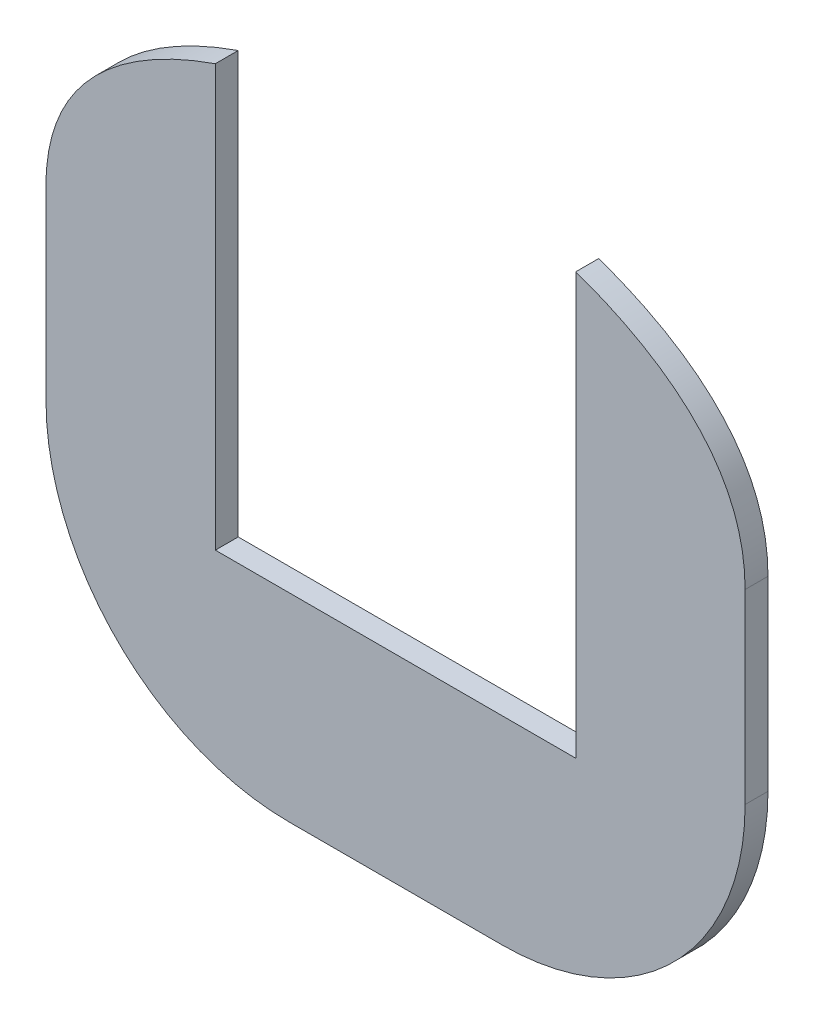
ISO-10303-21;
HEADER;
FILE_DESCRIPTION(('STEP AP214'),'2;1');
FILE_NAME('part.step','',(''),(''),'','','');
FILE_SCHEMA(('AUTOMOTIVE_DESIGN { 1 0 10303 214 1 1 1 1 }'));
ENDSEC;
DATA;
#1=APPLICATION_CONTEXT('core data for automotive mechanical design processes');
#2=APPLICATION_PROTOCOL_DEFINITION('international standard','automotive_design',2000,#1);
#3=PRODUCT_CONTEXT('',#1,'mechanical');
#4=PRODUCT('Part','Part','',(#3));
#5=PRODUCT_RELATED_PRODUCT_CATEGORY('part','',(#4));
#6=PRODUCT_DEFINITION_FORMATION('','',#4);
#7=PRODUCT_DEFINITION_CONTEXT('part definition',#1,'design');
#8=PRODUCT_DEFINITION('design','',#6,#7);
#9=PRODUCT_DEFINITION_SHAPE('','',#8);
#10=(LENGTH_UNIT() NAMED_UNIT(*) SI_UNIT(.MILLI.,.METRE.));
#11=(NAMED_UNIT(*) PLANE_ANGLE_UNIT() SI_UNIT($,.RADIAN.));
#12=(NAMED_UNIT(*) SI_UNIT($,.STERADIAN.) SOLID_ANGLE_UNIT());
#13=UNCERTAINTY_MEASURE_WITH_UNIT(LENGTH_MEASURE(1.E-05),#10,'distance_accuracy_value','');
#14=(GEOMETRIC_REPRESENTATION_CONTEXT(3) GLOBAL_UNCERTAINTY_ASSIGNED_CONTEXT((#13)) GLOBAL_UNIT_ASSIGNED_CONTEXT((#10,
#11,#12)) REPRESENTATION_CONTEXT('',''));
#15=CARTESIAN_POINT('',(0.,0.,0.));
#16=DIRECTION('',(0.,0.,1.));
#17=DIRECTION('',(1.,0.,0.));
#18=AXIS2_PLACEMENT_3D('',#15,#16,#17);
#19=CARTESIAN_POINT('',(-20.,-46.5,4.3));
#20=DIRECTION('',(0.,0.,-1.));
#21=DIRECTION('',(-1.,0.,0.));
#22=AXIS2_PLACEMENT_3D('',#19,#20,#21);
#23=CYLINDRICAL_SURFACE('',#22,45.7);
#24=CARTESIAN_POINT('',(-20.,-46.5,0.));
#25=DIRECTION('',(0.,0.,1.));
#26=DIRECTION('',(1.,0.,0.));
#27=AXIS2_PLACEMENT_3D('',#24,#25,#26);
#28=CIRCLE('',#27,45.7);
#29=CARTESIAN_POINT('',(-65.7,-46.5,0.));
#30=VERTEX_POINT('',#29);
#31=CARTESIAN_POINT('',(-20.,-92.2,0.));
#32=VERTEX_POINT('',#31);
#33=EDGE_CURVE('E178',#30,#32,#28,.T.);
#34=ORIENTED_EDGE('',*,*,#33,.T.);
#35=DIRECTION('',(0.,0.,-1.));
#36=VECTOR('',#35,1.);
#37=CARTESIAN_POINT('',(-20.,-92.2,4.3));
#38=LINE('',#37,#36);
#39=CARTESIAN_POINT('',(-20.,-92.2,4.3));
#40=VERTEX_POINT('',#39);
#41=EDGE_CURVE('E172',#40,#32,#38,.T.);
#42=ORIENTED_EDGE('',*,*,#41,.F.);
#43=CARTESIAN_POINT('',(-20.,-46.5,4.3));
#44=DIRECTION('',(0.,0.,1.));
#45=DIRECTION('',(1.,0.,0.));
#46=AXIS2_PLACEMENT_3D('',#43,#44,#45);
#47=CIRCLE('',#46,45.7);
#48=CARTESIAN_POINT('',(-65.7,-46.5,4.3));
#49=VERTEX_POINT('',#48);
#50=EDGE_CURVE('E202',#49,#40,#47,.T.);
#51=ORIENTED_EDGE('',*,*,#50,.F.);
#52=DIRECTION('',(0.,0.,-1.));
#53=VECTOR('',#52,1.);
#54=CARTESIAN_POINT('',(-65.7,-46.5,4.3));
#55=LINE('',#54,#53);
#56=EDGE_CURVE('E203',#49,#30,#55,.T.);
#57=ORIENTED_EDGE('',*,*,#56,.T.);
#58=EDGE_LOOP('',(#34,#42,#51,#57));
#59=FACE_BOUND('',#58,.T.);
#60=ADVANCED_FACE('F40',(#59),#23,.T.);
#61=CARTESIAN_POINT('',(-14.4294753014943,-92.2,4.3));
#62=DIRECTION('',(0.,1.,0.));
#63=DIRECTION('',(0.,0.,1.));
#64=AXIS2_PLACEMENT_3D('',#61,#62,#63);
#65=PLANE('',#64);
#66=DIRECTION('',(1.,0.,0.));
#67=VECTOR('',#66,1.);
#68=CARTESIAN_POINT('',(-14.4294753014943,-92.2,0.));
#69=LINE('',#68,#67);
#70=CARTESIAN_POINT('',(20.0000000000001,-92.2,0.));
#71=VERTEX_POINT('',#70);
#72=EDGE_CURVE('E168',#32,#71,#69,.T.);
#73=ORIENTED_EDGE('',*,*,#72,.T.);
#74=DIRECTION('',(0.,0.,-1.));
#75=VECTOR('',#74,1.);
#76=CARTESIAN_POINT('',(20.0000000000001,-92.2,4.3));
#77=LINE('',#76,#75);
#78=CARTESIAN_POINT('',(20.0000000000001,-92.2,4.3));
#79=VERTEX_POINT('',#78);
#80=EDGE_CURVE('E170',#79,#71,#77,.T.);
#81=ORIENTED_EDGE('',*,*,#80,.F.);
#82=DIRECTION('',(1.,0.,0.));
#83=VECTOR('',#82,1.);
#84=CARTESIAN_POINT('',(-20.,-92.2,4.3));
#85=LINE('',#84,#83);
#86=EDGE_CURVE('E99',#40,#79,#85,.T.);
#87=ORIENTED_EDGE('',*,*,#86,.F.);
#88=ORIENTED_EDGE('',*,*,#41,.T.);
#89=EDGE_LOOP('',(#73,#81,#87,#88));
#90=FACE_BOUND('',#89,.T.);
#91=ADVANCED_FACE('F161',(#90),#65,.F.);
#92=CARTESIAN_POINT('',(20.0000000000001,-46.5,4.3));
#93=DIRECTION('',(0.,0.,-1.));
#94=DIRECTION('',(-1.,0.,0.));
#95=AXIS2_PLACEMENT_3D('',#92,#93,#94);
#96=CYLINDRICAL_SURFACE('',#95,45.7);
#97=CARTESIAN_POINT('',(20.0000000000001,-46.5,0.));
#98=DIRECTION('',(0.,0.,1.));
#99=DIRECTION('',(1.,0.,0.));
#100=AXIS2_PLACEMENT_3D('',#97,#98,#99);
#101=CIRCLE('',#100,45.7);
#102=CARTESIAN_POINT('',(65.7000000000001,-46.5,0.));
#103=VERTEX_POINT('',#102);
#104=EDGE_CURVE('E177',#71,#103,#101,.T.);
#105=ORIENTED_EDGE('',*,*,#104,.T.);
#106=DIRECTION('',(0.,0.,-1.));
#107=VECTOR('',#106,1.);
#108=CARTESIAN_POINT('',(65.7000000000001,-46.5,4.3));
#109=LINE('',#108,#107);
#110=CARTESIAN_POINT('',(65.7000000000001,-46.5,4.3));
#111=VERTEX_POINT('',#110);
#112=EDGE_CURVE('E130',#111,#103,#109,.T.);
#113=ORIENTED_EDGE('',*,*,#112,.F.);
#114=CARTESIAN_POINT('',(20.0000000000001,-46.5,4.3));
#115=DIRECTION('',(0.,0.,1.));
#116=DIRECTION('',(1.,0.,0.));
#117=AXIS2_PLACEMENT_3D('',#114,#115,#116);
#118=CIRCLE('',#117,45.7);
#119=EDGE_CURVE('E117',#79,#111,#118,.T.);
#120=ORIENTED_EDGE('',*,*,#119,.F.);
#121=ORIENTED_EDGE('',*,*,#80,.T.);
#122=EDGE_LOOP('',(#105,#113,#120,#121));
#123=FACE_BOUND('',#122,.T.);
#124=ADVANCED_FACE('F159',(#123),#96,.T.);
#125=CARTESIAN_POINT('',(65.7,-11.5,4.3));
#126=DIRECTION('',(-1.,0.,0.));
#127=DIRECTION('',(0.,-1.,0.));
#128=AXIS2_PLACEMENT_3D('',#125,#126,#127);
#129=PLANE('',#128);
#130=DIRECTION('',(0.,1.,0.));
#131=VECTOR('',#130,1.);
#132=CARTESIAN_POINT('',(65.7,-11.5,0.));
#133=LINE('',#132,#131);
#134=CARTESIAN_POINT('',(65.7,-11.5,0.));
#135=VERTEX_POINT('',#134);
#136=EDGE_CURVE('E126',#103,#135,#133,.T.);
#137=ORIENTED_EDGE('',*,*,#136,.T.);
#138=DIRECTION('',(0.,0.,-1.));
#139=VECTOR('',#138,1.);
#140=CARTESIAN_POINT('',(65.7,-11.5,4.3));
#141=LINE('',#140,#139);
#142=CARTESIAN_POINT('',(65.7,-11.5,4.3));
#143=VERTEX_POINT('',#142);
#144=EDGE_CURVE('E123',#143,#135,#141,.T.);
#145=ORIENTED_EDGE('',*,*,#144,.F.);
#146=DIRECTION('',(0.,1.,0.));
#147=VECTOR('',#146,1.);
#148=CARTESIAN_POINT('',(65.7,-11.5,4.3));
#149=LINE('',#148,#147);
#150=EDGE_CURVE('E109',#111,#143,#149,.T.);
#151=ORIENTED_EDGE('',*,*,#150,.F.);
#152=ORIENTED_EDGE('',*,*,#112,.T.);
#153=EDGE_LOOP('',(#137,#145,#151,#152));
#154=FACE_BOUND('',#153,.T.);
#155=ADVANCED_FACE('F124',(#154),#129,.F.);
#156=CARTESIAN_POINT('',(65.7,-11.5,4.3));
#157=CARTESIAN_POINT('',(65.7,-10.9755899583671,4.3));
#158=CARTESIAN_POINT('',(65.677234407799,-9.91549097796304,4.3));
#159=CARTESIAN_POINT('',(65.5441870414575,-7.88841293925266,4.3));
#160=CARTESIAN_POINT('',(65.220242617562,-5.46067195182682,4.3));
#161=CARTESIAN_POINT('',(64.5980627687172,-2.72371582524321,4.3));
#162=CARTESIAN_POINT('',(63.4785155326464,0.716203599535267,4.3));
#163=CARTESIAN_POINT('',(61.5699490088853,4.65452752002481,4.3));
#164=CARTESIAN_POINT('',(58.5534228762426,8.88527505087892,4.3));
#165=CARTESIAN_POINT('',(54.896250472532,12.6626147651157,4.3));
#166=CARTESIAN_POINT('',(49.3051589495504,17.1177502677086,4.3));
#167=CARTESIAN_POINT('',(41.2794443055255,21.6169423973493,4.3));
#168=CARTESIAN_POINT('',(32.8026150450985,24.7807297336521,4.3));
#169=CARTESIAN_POINT('',(26.3389158503498,26.6062450199433,4.3));
#170=CARTESIAN_POINT('',(21.7972115308563,27.6517809376323,4.3));
#171=CARTESIAN_POINT('',(17.7102182701353,28.403936400297,4.3));
#172=CARTESIAN_POINT('',(14.8086873614499,28.8127381630495,4.3));
#173=CARTESIAN_POINT('',(12.8723127777568,29.0253496461649,4.3));
#174=CARTESIAN_POINT('',(11.6336485809542,29.1318563530486,4.3));
#175=CARTESIAN_POINT('',(10.8115232746335,29.1802031883283,4.3));
#176=CARTESIAN_POINT('',(10.2829881458273,29.1975933707137,4.3));
#177=CARTESIAN_POINT('',(10.1012123889315,29.2,4.3));
#178=CARTESIAN_POINT('',(10.,29.2,4.3));
#179=B_SPLINE_CURVE_WITH_KNOTS('',3,(#156,#157,#158,#159,#160,#161,#162,#163,#164,#165,#166,
#167,#168,#169,#170,#171,#172,#173,#174,#175,#176,#177,#178),.UNSPECIFIED.,.F.,.F.,(4,1,1,1,1,1,
1,1,1,1,1,1,1,1,1,1,1,1,1,1,4),(0.,0.015625,0.03125,0.0625,0.09375,0.125,0.1875,0.25,0.3125,
0.375,0.5,0.625,0.6875,0.75,0.8125,0.875,0.90625,0.9375,0.96875,0.984375,1.),.UNSPECIFIED.);
#180=DIRECTION('',(0.,0.,-1.));
#181=VECTOR('',#180,1.);
#182=SURFACE_OF_LINEAR_EXTRUSION('',#179,#181);
#183=CARTESIAN_POINT('',(65.7,-11.5,0.));
#184=CARTESIAN_POINT('',(65.7,-10.9755899583671,0.));
#185=CARTESIAN_POINT('',(65.677234407799,-9.91549097796304,0.));
#186=CARTESIAN_POINT('',(65.5441870414575,-7.88841293925266,0.));
#187=CARTESIAN_POINT('',(65.220242617562,-5.46067195182682,0.));
#188=CARTESIAN_POINT('',(64.5980627687172,-2.72371582524321,0.));
#189=CARTESIAN_POINT('',(63.4785155326464,0.716203599535267,0.));
#190=CARTESIAN_POINT('',(61.5699490088853,4.65452752002481,0.));
#191=CARTESIAN_POINT('',(58.5534228762426,8.88527505087892,0.));
#192=CARTESIAN_POINT('',(54.896250472532,12.6626147651157,0.));
#193=CARTESIAN_POINT('',(49.3051589495504,17.1177502677086,0.));
#194=CARTESIAN_POINT('',(41.2794443055255,21.6169423973493,0.));
#195=CARTESIAN_POINT('',(32.8026150450985,24.7807297336521,0.));
#196=CARTESIAN_POINT('',(26.3389158503498,26.6062450199433,0.));
#197=CARTESIAN_POINT('',(21.7972115308563,27.6517809376323,0.));
#198=CARTESIAN_POINT('',(17.7102182701353,28.403936400297,0.));
#199=CARTESIAN_POINT('',(14.8086873614499,28.8127381630495,0.));
#200=CARTESIAN_POINT('',(12.8723127777568,29.0253496461649,0.));
#201=CARTESIAN_POINT('',(11.6336485809542,29.1318563530486,0.));
#202=CARTESIAN_POINT('',(10.8115232746335,29.1802031883283,0.));
#203=CARTESIAN_POINT('',(10.2829881458273,29.1975933707137,0.));
#204=CARTESIAN_POINT('',(10.1012123889315,29.2,0.));
#205=CARTESIAN_POINT('',(10.,29.2,0.));
#206=B_SPLINE_CURVE_WITH_KNOTS('',3,(#183,#184,#185,#186,#187,#188,#189,#190,#191,#192,#193,
#194,#195,#196,#197,#198,#199,#200,#201,#202,#203,#204,#205),.UNSPECIFIED.,.F.,.F.,(4,1,1,1,1,1,
1,1,1,1,1,1,1,1,1,1,1,1,1,1,4),(0.,0.015625,0.03125,0.0625,0.09375,0.125,0.1875,0.25,0.3125,
0.375,0.5,0.625,0.6875,0.75,0.8125,0.875,0.90625,0.9375,0.96875,0.984375,1.),.UNSPECIFIED.);
#207=CARTESIAN_POINT('',(33.87,24.2997486559745,0.));
#208=VERTEX_POINT('',#207);
#209=EDGE_CURVE('E184',#135,#208,#206,.T.);
#210=ORIENTED_EDGE('',*,*,#209,.T.);
#211=DIRECTION('',(0.,0.,-1.));
#212=VECTOR('',#211,1.);
#213=CARTESIAN_POINT('',(33.87,24.2997486559022,4.3));
#214=LINE('',#213,#212);
#215=CARTESIAN_POINT('',(33.87,24.2997486559745,4.3));
#216=VERTEX_POINT('',#215);
#217=EDGE_CURVE('E136',#208,#216,#214,.F.);
#218=ORIENTED_EDGE('',*,*,#217,.T.);
#219=EDGE_CURVE('E115',#143,#216,#179,.T.);
#220=ORIENTED_EDGE('',*,*,#219,.F.);
#221=ORIENTED_EDGE('',*,*,#144,.T.);
#222=EDGE_LOOP('',(#210,#218,#220,#221));
#223=FACE_BOUND('',#222,.T.);
#224=ADVANCED_FACE('F134',(#223),#182,.F.);
#225=CARTESIAN_POINT('',(-10.,29.2,4.3));
#226=CARTESIAN_POINT('',(-10.1012123889315,29.2,4.3));
#227=CARTESIAN_POINT('',(-10.2829881458273,29.1975933707137,4.3));
#228=CARTESIAN_POINT('',(-10.8115232746335,29.1802031883283,4.3));
#229=CARTESIAN_POINT('',(-11.6336485809542,29.1318563530485,4.3));
#230=CARTESIAN_POINT('',(-12.8723127777568,29.0253496461649,4.3));
#231=CARTESIAN_POINT('',(-14.80868736145,28.8127381630495,4.3));
#232=CARTESIAN_POINT('',(-17.7102182701353,28.403936400297,4.3));
#233=CARTESIAN_POINT('',(-21.7972115308563,27.6517809376323,4.3));
#234=CARTESIAN_POINT('',(-26.3389158503498,26.6062450199433,4.3));
#235=CARTESIAN_POINT('',(-32.8026150450985,24.7807297336521,4.3));
#236=CARTESIAN_POINT('',(-41.2794443055255,21.6169423973493,4.3));
#237=CARTESIAN_POINT('',(-49.3051589495504,17.1177502677086,4.3));
#238=CARTESIAN_POINT('',(-54.896250472532,12.6626147651157,4.3));
#239=CARTESIAN_POINT('',(-58.5534228762426,8.88527505087891,4.3));
#240=CARTESIAN_POINT('',(-61.5699490088853,4.6545275200248,4.3));
#241=CARTESIAN_POINT('',(-63.4785155326464,0.716203599535257,4.3));
#242=CARTESIAN_POINT('',(-64.5980627687172,-2.72371582524323,4.3));
#243=CARTESIAN_POINT('',(-65.220242617562,-5.46067195182683,4.3));
#244=CARTESIAN_POINT('',(-65.5441870414575,-7.88841293925267,4.3));
#245=CARTESIAN_POINT('',(-65.677234407799,-9.91549097796306,4.3));
#246=CARTESIAN_POINT('',(-65.7,-10.9755899583671,4.3));
#247=CARTESIAN_POINT('',(-65.7,-11.5,4.3));
#248=B_SPLINE_CURVE_WITH_KNOTS('',3,(#225,#226,#227,#228,#229,#230,#231,#232,#233,#234,#235,
#236,#237,#238,#239,#240,#241,#242,#243,#244,#245,#246,#247),.UNSPECIFIED.,.F.,.F.,(4,1,1,1,1,1,
1,1,1,1,1,1,1,1,1,1,1,1,1,1,4),(0.,0.015625,0.03125,0.0625,0.09375,0.125,0.1875,0.25,0.3125,
0.375,0.5,0.625,0.6875,0.75,0.8125,0.875,0.90625,0.9375,0.96875,0.984375,1.),.UNSPECIFIED.);
#249=DIRECTION('',(0.,0.,-1.));
#250=VECTOR('',#249,1.);
#251=SURFACE_OF_LINEAR_EXTRUSION('',#248,#250);
#252=CARTESIAN_POINT('',(-33.87,24.2997486525097,4.3));
#253=VERTEX_POINT('',#252);
#254=CARTESIAN_POINT('',(-65.7,-11.5,4.3));
#255=VERTEX_POINT('',#254);
#256=EDGE_CURVE('E137',#253,#255,#248,.T.);
#257=ORIENTED_EDGE('',*,*,#256,.F.);
#258=DIRECTION('',(0.,0.,-1.));
#259=VECTOR('',#258,1.);
#260=CARTESIAN_POINT('',(-33.87,24.2997486559022,4.3));
#261=LINE('',#260,#259);
#262=CARTESIAN_POINT('',(-33.87,24.2997486525097,0.));
#263=VERTEX_POINT('',#262);
#264=EDGE_CURVE('E227',#253,#263,#261,.T.);
#265=ORIENTED_EDGE('',*,*,#264,.T.);
#266=CARTESIAN_POINT('',(-10.,29.2,0.));
#267=CARTESIAN_POINT('',(-10.1012123889315,29.2,0.));
#268=CARTESIAN_POINT('',(-10.2829881458273,29.1975933707137,0.));
#269=CARTESIAN_POINT('',(-10.8115232746335,29.1802031883283,0.));
#270=CARTESIAN_POINT('',(-11.6336485809542,29.1318563530485,0.));
#271=CARTESIAN_POINT('',(-12.8723127777568,29.0253496461649,0.));
#272=CARTESIAN_POINT('',(-14.80868736145,28.8127381630495,0.));
#273=CARTESIAN_POINT('',(-17.7102182701353,28.403936400297,0.));
#274=CARTESIAN_POINT('',(-21.7972115308563,27.6517809376323,0.));
#275=CARTESIAN_POINT('',(-26.3389158503498,26.6062450199433,0.));
#276=CARTESIAN_POINT('',(-32.8026150450985,24.7807297336521,0.));
#277=CARTESIAN_POINT('',(-41.2794443055255,21.6169423973493,0.));
#278=CARTESIAN_POINT('',(-49.3051589495504,17.1177502677086,0.));
#279=CARTESIAN_POINT('',(-54.896250472532,12.6626147651157,0.));
#280=CARTESIAN_POINT('',(-58.5534228762426,8.88527505087891,0.));
#281=CARTESIAN_POINT('',(-61.5699490088853,4.6545275200248,0.));
#282=CARTESIAN_POINT('',(-63.4785155326464,0.716203599535257,0.));
#283=CARTESIAN_POINT('',(-64.5980627687172,-2.72371582524323,0.));
#284=CARTESIAN_POINT('',(-65.220242617562,-5.46067195182683,0.));
#285=CARTESIAN_POINT('',(-65.5441870414575,-7.88841293925267,0.));
#286=CARTESIAN_POINT('',(-65.677234407799,-9.91549097796306,0.));
#287=CARTESIAN_POINT('',(-65.7,-10.9755899583671,0.));
#288=CARTESIAN_POINT('',(-65.7,-11.5,0.));
#289=B_SPLINE_CURVE_WITH_KNOTS('',3,(#266,#267,#268,#269,#270,#271,#272,#273,#274,#275,#276,
#277,#278,#279,#280,#281,#282,#283,#284,#285,#286,#287,#288),.UNSPECIFIED.,.F.,.F.,(4,1,1,1,1,1,
1,1,1,1,1,1,1,1,1,1,1,1,1,1,4),(0.,0.015625,0.03125,0.0625,0.09375,0.125,0.1875,0.25,0.3125,
0.375,0.5,0.625,0.6875,0.75,0.8125,0.875,0.90625,0.9375,0.96875,0.984375,1.),.UNSPECIFIED.);
#290=CARTESIAN_POINT('',(-65.7,-11.5,0.));
#291=VERTEX_POINT('',#290);
#292=EDGE_CURVE('E191',#263,#291,#289,.T.);
#293=ORIENTED_EDGE('',*,*,#292,.T.);
#294=DIRECTION('',(0.,0.,-1.));
#295=VECTOR('',#294,1.);
#296=CARTESIAN_POINT('',(-65.7,-11.5,4.3));
#297=LINE('',#296,#295);
#298=EDGE_CURVE('E131',#255,#291,#297,.T.);
#299=ORIENTED_EDGE('',*,*,#298,.F.);
#300=EDGE_LOOP('',(#257,#265,#293,#299));
#301=FACE_BOUND('',#300,.T.);
#302=ADVANCED_FACE('F155',(#301),#251,.F.);
#303=CARTESIAN_POINT('',(-65.7,-11.5,4.3));
#304=DIRECTION('',(1.,0.,0.));
#305=DIRECTION('',(0.,1.,0.));
#306=AXIS2_PLACEMENT_3D('',#303,#304,#305);
#307=PLANE('',#306);
#308=DIRECTION('',(0.,-1.,0.));
#309=VECTOR('',#308,1.);
#310=CARTESIAN_POINT('',(-65.7,-11.5,0.));
#311=LINE('',#310,#309);
#312=EDGE_CURVE('E90',#291,#30,#311,.T.);
#313=ORIENTED_EDGE('',*,*,#312,.T.);
#314=ORIENTED_EDGE('',*,*,#56,.F.);
#315=DIRECTION('',(0.,-1.,0.));
#316=VECTOR('',#315,1.);
#317=CARTESIAN_POINT('',(-65.7,-11.5,4.3));
#318=LINE('',#317,#316);
#319=EDGE_CURVE('E63',#255,#49,#318,.T.);
#320=ORIENTED_EDGE('',*,*,#319,.F.);
#321=ORIENTED_EDGE('',*,*,#298,.T.);
#322=EDGE_LOOP('',(#313,#314,#320,#321));
#323=FACE_BOUND('',#322,.T.);
#324=ADVANCED_FACE('F245',(#323),#307,.F.);
#325=CARTESIAN_POINT('',(-20.,-46.5,4.3));
#326=DIRECTION('',(0.,0.,1.));
#327=DIRECTION('',(1.,0.,0.));
#328=AXIS2_PLACEMENT_3D('',#325,#326,#327);
#329=PLANE('',#328);
#330=DIRECTION('',(0.,1.,0.));
#331=VECTOR('',#330,1.);
#332=CARTESIAN_POINT('',(33.87,24.2997486559022,4.3));
#333=LINE('',#332,#331);
#334=CARTESIAN_POINT('',(33.87,-54.8802513440978,4.3));
#335=VERTEX_POINT('',#334);
#336=EDGE_CURVE('E231',#335,#216,#333,.T.);
#337=ORIENTED_EDGE('',*,*,#336,.F.);
#338=DIRECTION('',(1.,0.,0.));
#339=VECTOR('',#338,1.);
#340=CARTESIAN_POINT('',(-33.87,-54.8802513440978,4.3));
#341=LINE('',#340,#339);
#342=CARTESIAN_POINT('',(-33.87,-54.8802513440978,4.3));
#343=VERTEX_POINT('',#342);
#344=EDGE_CURVE('E224',#343,#335,#341,.T.);
#345=ORIENTED_EDGE('',*,*,#344,.F.);
#346=DIRECTION('',(0.,-1.,0.));
#347=VECTOR('',#346,1.);
#348=CARTESIAN_POINT('',(-33.87,24.2997486559022,4.3));
#349=LINE('',#348,#347);
#350=EDGE_CURVE('E268',#253,#343,#349,.T.);
#351=ORIENTED_EDGE('',*,*,#350,.F.);
#352=ORIENTED_EDGE('',*,*,#256,.T.);
#353=ORIENTED_EDGE('',*,*,#319,.T.);
#354=ORIENTED_EDGE('',*,*,#50,.T.);
#355=ORIENTED_EDGE('',*,*,#86,.T.);
#356=ORIENTED_EDGE('',*,*,#119,.T.);
#357=ORIENTED_EDGE('',*,*,#150,.T.);
#358=ORIENTED_EDGE('',*,*,#219,.T.);
#359=EDGE_LOOP('',(#337,#345,#351,#352,#353,#354,#355,#356,#357,#358));
#360=FACE_BOUND('',#359,.T.);
#361=ADVANCED_FACE('F112',(#360),#329,.T.);
#362=CARTESIAN_POINT('',(-20.,-46.5,0.));
#363=DIRECTION('',(0.,0.,1.));
#364=DIRECTION('',(1.,0.,0.));
#365=AXIS2_PLACEMENT_3D('',#362,#363,#364);
#366=PLANE('',#365);
#367=DIRECTION('',(1.,0.,0.));
#368=VECTOR('',#367,1.);
#369=CARTESIAN_POINT('',(-20.,-54.8802513440978,0.));
#370=LINE('',#369,#368);
#371=CARTESIAN_POINT('',(-33.87,-54.8802513440978,0.));
#372=VERTEX_POINT('',#371);
#373=CARTESIAN_POINT('',(33.87,-54.8802513440978,0.));
#374=VERTEX_POINT('',#373);
#375=EDGE_CURVE('E47',#372,#374,#370,.T.);
#376=ORIENTED_EDGE('',*,*,#375,.T.);
#377=DIRECTION('',(0.,1.,0.));
#378=VECTOR('',#377,1.);
#379=CARTESIAN_POINT('',(33.87,-46.5,0.));
#380=LINE('',#379,#378);
#381=EDGE_CURVE('E11',#374,#208,#380,.T.);
#382=ORIENTED_EDGE('',*,*,#381,.T.);
#383=ORIENTED_EDGE('',*,*,#209,.F.);
#384=ORIENTED_EDGE('',*,*,#136,.F.);
#385=ORIENTED_EDGE('',*,*,#104,.F.);
#386=ORIENTED_EDGE('',*,*,#72,.F.);
#387=ORIENTED_EDGE('',*,*,#33,.F.);
#388=ORIENTED_EDGE('',*,*,#312,.F.);
#389=ORIENTED_EDGE('',*,*,#292,.F.);
#390=DIRECTION('',(0.,-1.,0.));
#391=VECTOR('',#390,1.);
#392=CARTESIAN_POINT('',(-33.87,-46.5,0.));
#393=LINE('',#392,#391);
#394=EDGE_CURVE('E208',#263,#372,#393,.T.);
#395=ORIENTED_EDGE('',*,*,#394,.T.);
#396=EDGE_LOOP('',(#376,#382,#383,#384,#385,#386,#387,#388,#389,#395));
#397=FACE_BOUND('',#396,.T.);
#398=ADVANCED_FACE('F182',(#397),#366,.F.);
#399=CARTESIAN_POINT('',(33.87,24.2997486559022,-5.7));
#400=DIRECTION('',(1.,0.,0.));
#401=DIRECTION('',(0.,0.,-1.));
#402=AXIS2_PLACEMENT_3D('',#399,#400,#401);
#403=PLANE('',#402);
#404=ORIENTED_EDGE('',*,*,#381,.F.);
#405=DIRECTION('',(0.,0.,1.));
#406=VECTOR('',#405,1.);
#407=CARTESIAN_POINT('',(33.87,-54.8802513440978,-5.7));
#408=LINE('',#407,#406);
#409=EDGE_CURVE('E221',#374,#335,#408,.T.);
#410=ORIENTED_EDGE('',*,*,#409,.T.);
#411=ORIENTED_EDGE('',*,*,#336,.T.);
#412=ORIENTED_EDGE('',*,*,#217,.F.);
#413=EDGE_LOOP('',(#404,#410,#411,#412));
#414=FACE_BOUND('',#413,.T.);
#415=ADVANCED_FACE('F254',(#414),#403,.F.);
#416=CARTESIAN_POINT('',(-33.87,-54.8802513440978,-5.7));
#417=DIRECTION('',(0.,-1.,0.));
#418=DIRECTION('',(0.,0.,-1.));
#419=AXIS2_PLACEMENT_3D('',#416,#417,#418);
#420=PLANE('',#419);
#421=DIRECTION('',(0.,0.,1.));
#422=VECTOR('',#421,1.);
#423=CARTESIAN_POINT('',(-33.87,-54.8802513440978,-5.7));
#424=LINE('',#423,#422);
#425=EDGE_CURVE('E54',#372,#343,#424,.T.);
#426=ORIENTED_EDGE('',*,*,#425,.T.);
#427=ORIENTED_EDGE('',*,*,#344,.T.);
#428=ORIENTED_EDGE('',*,*,#409,.F.);
#429=ORIENTED_EDGE('',*,*,#375,.F.);
#430=EDGE_LOOP('',(#426,#427,#428,#429));
#431=FACE_BOUND('',#430,.T.);
#432=ADVANCED_FACE('F217',(#431),#420,.F.);
#433=CARTESIAN_POINT('',(-33.87,24.2997486559022,-5.7));
#434=DIRECTION('',(-1.,0.,0.));
#435=DIRECTION('',(0.,-1.,0.));
#436=AXIS2_PLACEMENT_3D('',#433,#434,#435);
#437=PLANE('',#436);
#438=ORIENTED_EDGE('',*,*,#350,.T.);
#439=ORIENTED_EDGE('',*,*,#425,.F.);
#440=ORIENTED_EDGE('',*,*,#394,.F.);
#441=ORIENTED_EDGE('',*,*,#264,.F.);
#442=EDGE_LOOP('',(#438,#439,#440,#441));
#443=FACE_BOUND('',#442,.T.);
#444=ADVANCED_FACE('F256',(#443),#437,.F.);
#445=CLOSED_SHELL('',(#60,#91,#124,#155,#224,#302,#324,#361,#398,#415,#432,#444));
#446=MANIFOLD_SOLID_BREP('B2',#445);
#447=ADVANCED_BREP_SHAPE_REPRESENTATION('',(#18,#446),#14);
#448=SHAPE_DEFINITION_REPRESENTATION(#9,#447);
ENDSEC;
END-ISO-10303-21;
